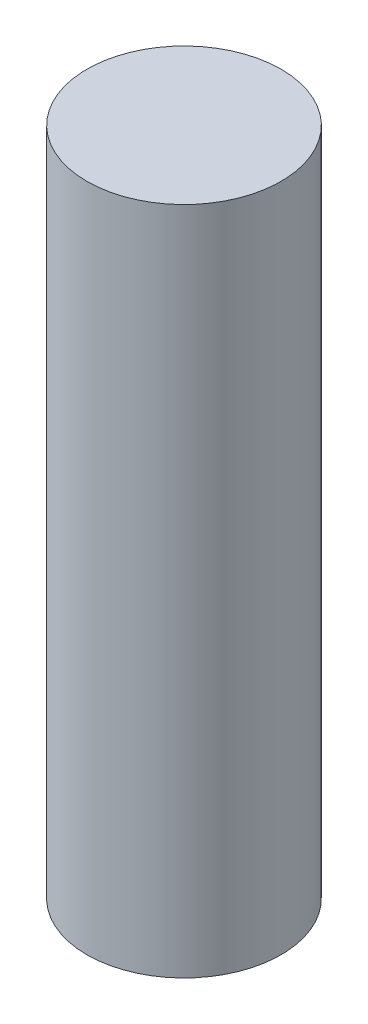
ISO-10303-21;
HEADER;
FILE_DESCRIPTION(('STEP AP214'),'2;1');
FILE_NAME('part.step','',(''),(''),'','','');
FILE_SCHEMA(('AUTOMOTIVE_DESIGN { 1 0 10303 214 1 1 1 1 }'));
ENDSEC;
DATA;
#1=APPLICATION_CONTEXT('core data for automotive mechanical design processes');
#2=APPLICATION_PROTOCOL_DEFINITION('international standard','automotive_design',2000,#1);
#3=PRODUCT_CONTEXT('',#1,'mechanical');
#4=PRODUCT('Part','Part','',(#3));
#5=PRODUCT_RELATED_PRODUCT_CATEGORY('part','',(#4));
#6=PRODUCT_DEFINITION_FORMATION('','',#4);
#7=PRODUCT_DEFINITION_CONTEXT('part definition',#1,'design');
#8=PRODUCT_DEFINITION('design','',#6,#7);
#9=PRODUCT_DEFINITION_SHAPE('','',#8);
#10=(LENGTH_UNIT() NAMED_UNIT(*) SI_UNIT(.MILLI.,.METRE.));
#11=(NAMED_UNIT(*) PLANE_ANGLE_UNIT() SI_UNIT($,.RADIAN.));
#12=(NAMED_UNIT(*) SI_UNIT($,.STERADIAN.) SOLID_ANGLE_UNIT());
#13=UNCERTAINTY_MEASURE_WITH_UNIT(LENGTH_MEASURE(1.E-05),#10,'distance_accuracy_value','');
#14=(GEOMETRIC_REPRESENTATION_CONTEXT(3) GLOBAL_UNCERTAINTY_ASSIGNED_CONTEXT((#13)) GLOBAL_UNIT_ASSIGNED_CONTEXT((#10,
#11,#12)) REPRESENTATION_CONTEXT('',''));
#15=CARTESIAN_POINT('',(0.,0.,0.));
#16=DIRECTION('',(0.,0.,1.));
#17=DIRECTION('',(1.,0.,0.));
#18=AXIS2_PLACEMENT_3D('',#15,#16,#17);
#19=CARTESIAN_POINT('',(2.99981658054397,25.4,2.84381829760487));
#20=DIRECTION('',(0.,-1.,0.));
#21=DIRECTION('',(0.,0.,-1.));
#22=AXIS2_PLACEMENT_3D('',#19,#20,#21);
#23=CYLINDRICAL_SURFACE('',#22,3.683);
#24=CARTESIAN_POINT('',(2.99981658054397,25.4,2.84381829760487));
#25=DIRECTION('',(0.,1.,0.));
#26=DIRECTION('',(0.,0.,1.));
#27=AXIS2_PLACEMENT_3D('',#24,#25,#26);
#28=CIRCLE('',#27,3.683);
#29=CARTESIAN_POINT('',(2.99981658054397,25.4,6.52681829760487));
#30=VERTEX_POINT('',#29);
#31=EDGE_CURVE('E10',#30,#30,#28,.T.);
#32=ORIENTED_EDGE('',*,*,#31,.F.);
#33=EDGE_LOOP('',(#32));
#34=FACE_BOUND('',#33,.T.);
#35=CARTESIAN_POINT('',(2.99981658054397,0.,2.84381829760487));
#36=DIRECTION('',(0.,1.,0.));
#37=DIRECTION('',(0.,0.,1.));
#38=AXIS2_PLACEMENT_3D('',#35,#36,#37);
#39=CIRCLE('',#38,3.683);
#40=CARTESIAN_POINT('',(2.99981658054397,0.,6.52681829760487));
#41=VERTEX_POINT('',#40);
#42=EDGE_CURVE('E33',#41,#41,#39,.T.);
#43=ORIENTED_EDGE('',*,*,#42,.T.);
#44=EDGE_LOOP('',(#43));
#45=FACE_BOUND('',#44,.T.);
#46=ADVANCED_FACE('F30',(#34,#45),#23,.T.);
#47=CARTESIAN_POINT('',(2.99981658054397,25.4,2.84381829760487));
#48=DIRECTION('',(0.,1.,0.));
#49=DIRECTION('',(0.,0.,1.));
#50=AXIS2_PLACEMENT_3D('',#47,#48,#49);
#51=PLANE('',#50);
#52=ORIENTED_EDGE('',*,*,#31,.T.);
#53=EDGE_LOOP('',(#52));
#54=FACE_BOUND('',#53,.T.);
#55=ADVANCED_FACE('F45',(#54),#51,.T.);
#56=CARTESIAN_POINT('',(2.99981658054397,0.,2.84381829760487));
#57=DIRECTION('',(0.,1.,0.));
#58=DIRECTION('',(0.,0.,1.));
#59=AXIS2_PLACEMENT_3D('',#56,#57,#58);
#60=PLANE('',#59);
#61=ORIENTED_EDGE('',*,*,#42,.F.);
#62=EDGE_LOOP('',(#61));
#63=FACE_BOUND('',#62,.T.);
#64=ADVANCED_FACE('F43',(#63),#60,.F.);
#65=CLOSED_SHELL('',(#46,#55,#64));
#66=MANIFOLD_SOLID_BREP('B2',#65);
#67=ADVANCED_BREP_SHAPE_REPRESENTATION('',(#18,#66),#14);
#68=SHAPE_DEFINITION_REPRESENTATION(#9,#67);
ENDSEC;
END-ISO-10303-21;
